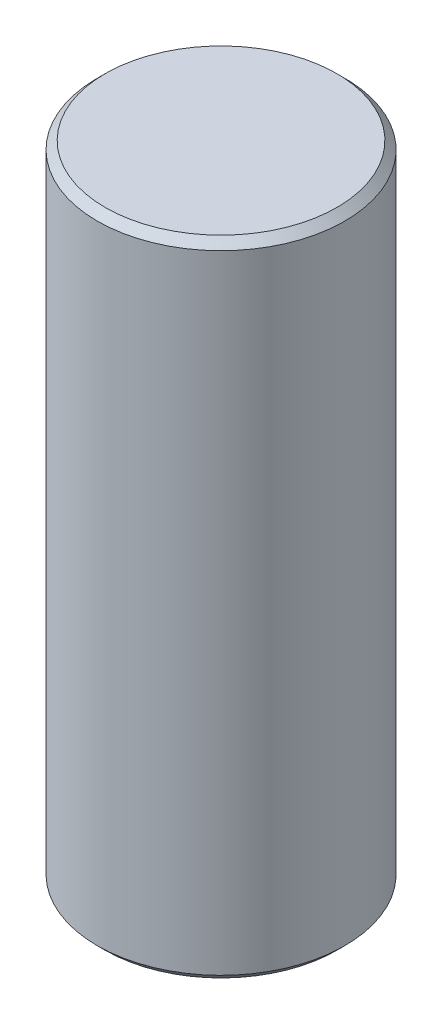
ISO-10303-21;
HEADER;
FILE_DESCRIPTION(('STEP AP214'),'2;1');
FILE_NAME('part.step','',(''),(''),'','','');
FILE_SCHEMA(('AUTOMOTIVE_DESIGN { 1 0 10303 214 1 1 1 1 }'));
ENDSEC;
DATA;
#1=APPLICATION_CONTEXT('core data for automotive mechanical design processes');
#2=APPLICATION_PROTOCOL_DEFINITION('international standard','automotive_design',2000,#1);
#3=PRODUCT_CONTEXT('',#1,'mechanical');
#4=PRODUCT('Part','Part','',(#3));
#5=PRODUCT_RELATED_PRODUCT_CATEGORY('part','',(#4));
#6=PRODUCT_DEFINITION_FORMATION('','',#4);
#7=PRODUCT_DEFINITION_CONTEXT('part definition',#1,'design');
#8=PRODUCT_DEFINITION('design','',#6,#7);
#9=PRODUCT_DEFINITION_SHAPE('','',#8);
#10=(LENGTH_UNIT() NAMED_UNIT(*) SI_UNIT(.MILLI.,.METRE.));
#11=(NAMED_UNIT(*) PLANE_ANGLE_UNIT() SI_UNIT($,.RADIAN.));
#12=(NAMED_UNIT(*) SI_UNIT($,.STERADIAN.) SOLID_ANGLE_UNIT());
#13=UNCERTAINTY_MEASURE_WITH_UNIT(LENGTH_MEASURE(1.E-05),#10,'distance_accuracy_value','');
#14=(GEOMETRIC_REPRESENTATION_CONTEXT(3) GLOBAL_UNCERTAINTY_ASSIGNED_CONTEXT((#13)) GLOBAL_UNIT_ASSIGNED_CONTEXT((#10,
#11,#12)) REPRESENTATION_CONTEXT('',''));
#15=CARTESIAN_POINT('',(0.,0.,0.));
#16=DIRECTION('',(0.,0.,1.));
#17=DIRECTION('',(1.,0.,0.));
#18=AXIS2_PLACEMENT_3D('',#15,#16,#17);
#19=CARTESIAN_POINT('',(0.,40.8,0.));
#20=DIRECTION('',(0.,-1.,0.));
#21=DIRECTION('',(0.,0.,-1.));
#22=AXIS2_PLACEMENT_3D('',#19,#20,#21);
#23=CYLINDRICAL_SURFACE('',#22,7.85);
#24=CARTESIAN_POINT('',(0.,0.5,0.));
#25=DIRECTION('',(0.,1.,0.));
#26=DIRECTION('',(0.,0.,1.));
#27=AXIS2_PLACEMENT_3D('',#24,#25,#26);
#28=CIRCLE('',#27,7.85);
#29=CARTESIAN_POINT('',(0.,0.5,7.85));
#30=VERTEX_POINT('',#29);
#31=EDGE_CURVE('E53',#30,#30,#28,.T.);
#32=ORIENTED_EDGE('',*,*,#31,.T.);
#33=EDGE_LOOP('',(#32));
#34=FACE_BOUND('',#33,.T.);
#35=CARTESIAN_POINT('',(0.,40.3,0.));
#36=DIRECTION('',(0.,1.,0.));
#37=DIRECTION('',(0.,0.,1.));
#38=AXIS2_PLACEMENT_3D('',#35,#36,#37);
#39=CIRCLE('',#38,7.85);
#40=CARTESIAN_POINT('',(0.,40.3,7.84999999999998));
#41=VERTEX_POINT('',#40);
#42=EDGE_CURVE('E59',#41,#41,#39,.F.);
#43=ORIENTED_EDGE('',*,*,#42,.T.);
#44=EDGE_LOOP('',(#43));
#45=FACE_BOUND('',#44,.T.);
#46=ADVANCED_FACE('F38',(#34,#45),#23,.T.);
#47=CARTESIAN_POINT('',(0.,40.8,0.));
#48=DIRECTION('',(0.,1.,0.));
#49=DIRECTION('',(0.,0.,1.));
#50=AXIS2_PLACEMENT_3D('',#47,#48,#49);
#51=PLANE('',#50);
#52=CARTESIAN_POINT('',(0.,40.8,0.));
#53=DIRECTION('',(0.,1.,0.));
#54=DIRECTION('',(0.,0.,1.));
#55=AXIS2_PLACEMENT_3D('',#52,#53,#54);
#56=CIRCLE('',#55,7.35);
#57=CARTESIAN_POINT('',(0.,40.8,7.34999999999998));
#58=VERTEX_POINT('',#57);
#59=EDGE_CURVE('E10',#58,#58,#56,.T.);
#60=ORIENTED_EDGE('',*,*,#59,.T.);
#61=EDGE_LOOP('',(#60));
#62=FACE_BOUND('',#61,.T.);
#63=ADVANCED_FACE('F77',(#62),#51,.T.);
#64=CARTESIAN_POINT('',(0.,0.,0.));
#65=DIRECTION('',(0.,1.,0.));
#66=DIRECTION('',(0.,0.,1.));
#67=AXIS2_PLACEMENT_3D('',#64,#65,#66);
#68=PLANE('',#67);
#69=CARTESIAN_POINT('',(0.,0.,0.));
#70=DIRECTION('',(0.,1.,0.));
#71=DIRECTION('',(0.,0.,1.));
#72=AXIS2_PLACEMENT_3D('',#69,#70,#71);
#73=CIRCLE('',#72,7.35);
#74=CARTESIAN_POINT('',(0.,0.,7.35));
#75=VERTEX_POINT('',#74);
#76=EDGE_CURVE('E47',#75,#75,#73,.F.);
#77=ORIENTED_EDGE('',*,*,#76,.T.);
#78=EDGE_LOOP('',(#77));
#79=FACE_BOUND('',#78,.T.);
#80=ADVANCED_FACE('F74',(#79),#68,.F.);
#81=CARTESIAN_POINT('',(0.,0.5,0.));
#82=DIRECTION('',(0.,1.,0.));
#83=DIRECTION('',(0.,0.,1.));
#84=AXIS2_PLACEMENT_3D('',#81,#82,#83);
#85=CONICAL_SURFACE('',#84,7.85,0.785398163397452);
#86=ORIENTED_EDGE('',*,*,#76,.F.);
#87=EDGE_LOOP('',(#86));
#88=FACE_BOUND('',#87,.T.);
#89=ORIENTED_EDGE('',*,*,#31,.F.);
#90=EDGE_LOOP('',(#89));
#91=FACE_BOUND('',#90,.T.);
#92=ADVANCED_FACE('F70',(#88,#91),#85,.T.);
#93=CARTESIAN_POINT('',(0.,40.8,0.));
#94=DIRECTION('',(0.,-1.,0.));
#95=DIRECTION('',(0.,0.,-1.));
#96=AXIS2_PLACEMENT_3D('',#93,#94,#95);
#97=CONICAL_SURFACE('',#96,7.35,0.785398163397452);
#98=ORIENTED_EDGE('',*,*,#42,.F.);
#99=EDGE_LOOP('',(#98));
#100=FACE_BOUND('',#99,.T.);
#101=ORIENTED_EDGE('',*,*,#59,.F.);
#102=EDGE_LOOP('',(#101));
#103=FACE_BOUND('',#102,.T.);
#104=ADVANCED_FACE('F41',(#100,#103),#97,.T.);
#105=CLOSED_SHELL('',(#46,#63,#80,#92,#104));
#106=MANIFOLD_SOLID_BREP('B2',#105);
#107=ADVANCED_BREP_SHAPE_REPRESENTATION('',(#18,#106),#14);
#108=SHAPE_DEFINITION_REPRESENTATION(#9,#107);
ENDSEC;
END-ISO-10303-21;
